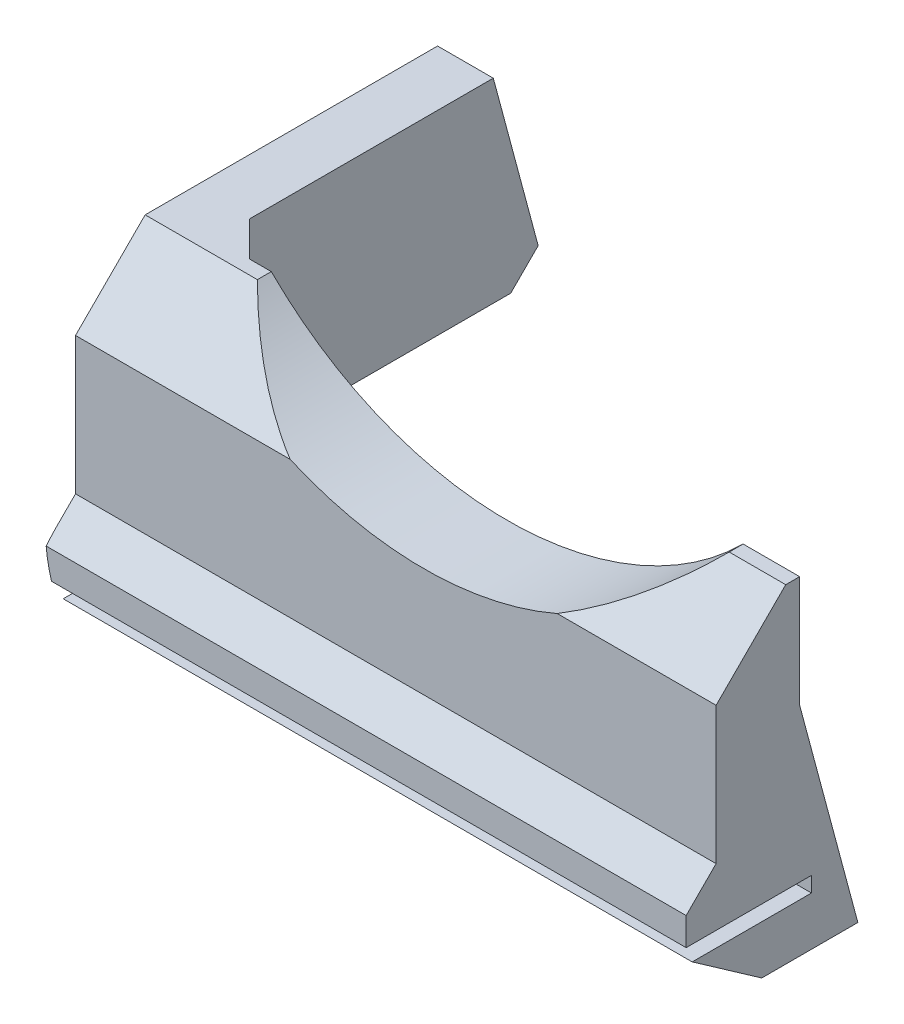
ISO-10303-21;
HEADER;
FILE_DESCRIPTION(('STEP AP214'),'2;1');
FILE_NAME('part.step','',(''),(''),'','','');
FILE_SCHEMA(('AUTOMOTIVE_DESIGN { 1 0 10303 214 1 1 1 1 }'));
ENDSEC;
DATA;
#1=APPLICATION_CONTEXT('core data for automotive mechanical design processes');
#2=APPLICATION_PROTOCOL_DEFINITION('international standard','automotive_design',2000,#1);
#3=PRODUCT_CONTEXT('',#1,'mechanical');
#4=PRODUCT('Part','Part','',(#3));
#5=PRODUCT_RELATED_PRODUCT_CATEGORY('part','',(#4));
#6=PRODUCT_DEFINITION_FORMATION('','',#4);
#7=PRODUCT_DEFINITION_CONTEXT('part definition',#1,'design');
#8=PRODUCT_DEFINITION('design','',#6,#7);
#9=PRODUCT_DEFINITION_SHAPE('','',#8);
#10=(LENGTH_UNIT() NAMED_UNIT(*) SI_UNIT(.MILLI.,.METRE.));
#11=(NAMED_UNIT(*) PLANE_ANGLE_UNIT() SI_UNIT($,.RADIAN.));
#12=(NAMED_UNIT(*) SI_UNIT($,.STERADIAN.) SOLID_ANGLE_UNIT());
#13=UNCERTAINTY_MEASURE_WITH_UNIT(LENGTH_MEASURE(1.E-05),#10,'distance_accuracy_value','');
#14=(GEOMETRIC_REPRESENTATION_CONTEXT(3) GLOBAL_UNCERTAINTY_ASSIGNED_CONTEXT((#13)) GLOBAL_UNIT_ASSIGNED_CONTEXT((#10,
#11,#12)) REPRESENTATION_CONTEXT('',''));
#15=CARTESIAN_POINT('',(0.,0.,0.));
#16=DIRECTION('',(0.,0.,1.));
#17=DIRECTION('',(1.,0.,0.));
#18=AXIS2_PLACEMENT_3D('',#15,#16,#17);
#19=CARTESIAN_POINT('',(21.,-6.,-4.));
#20=DIRECTION('',(0.,-0.258819045102525,0.965925826289067));
#21=DIRECTION('',(0.,-0.965925826289067,-0.258819045102525));
#22=AXIS2_PLACEMENT_3D('',#19,#20,#21);
#23=PLANE('',#22);
#24=DIRECTION('',(1.,0.,0.));
#25=VECTOR('',#24,1.);
#26=CARTESIAN_POINT('',(21.,3.42457351945711,-1.47469313645368));
#27=LINE('',#26,#25);
#28=CARTESIAN_POINT('',(-24.9834304908428,3.42457351945711,-1.47469313645368));
#29=VERTEX_POINT('',#28);
#30=CARTESIAN_POINT('',(-20.8245735194571,3.42457351945711,-1.47469313645368));
#31=VERTEX_POINT('',#30);
#32=EDGE_CURVE('E232',#29,#31,#27,.T.);
#33=ORIENTED_EDGE('',*,*,#32,.T.);
#34=DIRECTION('',(-0.250562807085739,-0.935113126531026,-0.250562807085735));
#35=VECTOR('',#34,1.);
#36=CARTESIAN_POINT('',(-12.6423857518416,33.9609139852658,6.70749463116171));
#37=LINE('',#36,#35);
#38=CARTESIAN_POINT('',(-18.5,12.1,0.849880383003405));
#39=VERTEX_POINT('',#38);
#40=EDGE_CURVE('E361',#31,#39,#37,.F.);
#41=ORIENTED_EDGE('',*,*,#40,.T.);
#42=DIRECTION('',(-1.,0.,0.));
#43=VECTOR('',#42,1.);
#44=CARTESIAN_POINT('',(21.,12.1,0.849880383003405));
#45=LINE('',#44,#43);
#46=CARTESIAN_POINT('',(21.,12.1,0.849880383003405));
#47=VERTEX_POINT('',#46);
#48=EDGE_CURVE('E306',#47,#39,#45,.T.);
#49=ORIENTED_EDGE('',*,*,#48,.F.);
#50=DIRECTION('',(0.,0.965925826289067,0.258819045102525));
#51=VECTOR('',#50,1.);
#52=CARTESIAN_POINT('',(21.,-6.,-4.));
#53=LINE('',#52,#51);
#54=CARTESIAN_POINT('',(21.,-3.5,-3.33012701892218));
#55=VERTEX_POINT('',#54);
#56=EDGE_CURVE('E263',#55,#47,#53,.T.);
#57=ORIENTED_EDGE('',*,*,#56,.F.);
#58=DIRECTION('',(0.694746590606867,0.694746590606863,0.186156787897388));
#59=VECTOR('',#58,1.);
#60=CARTESIAN_POINT('',(21.4306913006395,-3.06930869936054,-3.21472363272873));
#61=LINE('',#60,#59);
#62=CARTESIAN_POINT('',(18.5,-6.,-4.));
#63=VERTEX_POINT('',#62);
#64=EDGE_CURVE('E359',#55,#63,#61,.F.);
#65=ORIENTED_EDGE('',*,*,#64,.T.);
#66=DIRECTION('',(-1.,0.,0.));
#67=VECTOR('',#66,1.);
#68=CARTESIAN_POINT('',(21.,-6.,-4.));
#69=LINE('',#68,#67);
#70=CARTESIAN_POINT('',(-15.,-6.,-4.));
#71=VERTEX_POINT('',#70);
#72=EDGE_CURVE('E284',#63,#71,#69,.T.);
#73=ORIENTED_EDGE('',*,*,#72,.T.);
#74=CARTESIAN_POINT('',(-15.,4.,-1.32050807568873));
#75=DIRECTION('',(0.,-0.258819045102525,0.965925826289067));
#76=DIRECTION('',(0.,-0.965925826289067,-0.258819045102525));
#77=AXIS2_PLACEMENT_3D('',#74,#75,#76);
#78=ELLIPSE('',#77,10.3527618041008,10.);
#79=EDGE_CURVE('E343',#71,#29,#78,.F.);
#80=ORIENTED_EDGE('',*,*,#79,.T.);
#81=EDGE_LOOP('',(#33,#41,#49,#57,#65,#73,#80));
#82=FACE_BOUND('',#81,.T.);
#83=ADVANCED_FACE('F36',(#82),#23,.F.);
#84=CARTESIAN_POINT('',(21.,5.25011961699659,6.8498803830034));
#85=DIRECTION('',(0.,0.,-1.));
#86=DIRECTION('',(-1.,0.,0.));
#87=AXIS2_PLACEMENT_3D('',#84,#85,#86);
#88=PLANE('',#87);
#89=CARTESIAN_POINT('',(0.,37.1,6.8498803830034));
#90=DIRECTION('',(0.,0.,-1.));
#91=DIRECTION('',(-1.,0.,0.));
#92=AXIS2_PLACEMENT_3D('',#89,#90,#91);
#93=CIRCLE('',#92,24.);
#94=CARTESIAN_POINT('',(9.59166304662542,15.1,6.84988038300341));
#95=VERTEX_POINT('',#94);
#96=CARTESIAN_POINT('',(-9.59166304662542,15.1,6.84988038300341));
#97=VERTEX_POINT('',#96);
#98=EDGE_CURVE('E245',#95,#97,#93,.T.);
#99=ORIENTED_EDGE('',*,*,#98,.T.);
#100=DIRECTION('',(-1.,0.,0.));
#101=VECTOR('',#100,1.);
#102=CARTESIAN_POINT('',(-21.,15.1,6.8498803830034));
#103=LINE('',#102,#101);
#104=CARTESIAN_POINT('',(-25.,15.1,6.84988038300341));
#105=VERTEX_POINT('',#104);
#106=EDGE_CURVE('E312',#97,#105,#103,.T.);
#107=ORIENTED_EDGE('',*,*,#106,.T.);
#108=DIRECTION('',(0.,1.,0.));
#109=VECTOR('',#108,1.);
#110=CARTESIAN_POINT('',(-25.,5.25011961699659,6.8498803830034));
#111=LINE('',#110,#109);
#112=CARTESIAN_POINT('',(-25.,5.25011961699659,6.8498803830034));
#113=VERTEX_POINT('',#112);
#114=EDGE_CURVE('E237',#113,#105,#111,.T.);
#115=ORIENTED_EDGE('',*,*,#114,.F.);
#116=DIRECTION('',(-1.,0.,0.));
#117=VECTOR('',#116,1.);
#118=CARTESIAN_POINT('',(21.,5.25011961699659,6.8498803830034));
#119=LINE('',#118,#117);
#120=CARTESIAN_POINT('',(21.,5.25011961699659,6.8498803830034));
#121=VERTEX_POINT('',#120);
#122=EDGE_CURVE('E303',#121,#113,#119,.T.);
#123=ORIENTED_EDGE('',*,*,#122,.F.);
#124=DIRECTION('',(0.,-1.,0.));
#125=VECTOR('',#124,1.);
#126=CARTESIAN_POINT('',(21.,5.25011961699659,6.8498803830034));
#127=LINE('',#126,#125);
#128=CARTESIAN_POINT('',(21.,15.1,6.84988038300341));
#129=VERTEX_POINT('',#128);
#130=EDGE_CURVE('E270',#129,#121,#127,.T.);
#131=ORIENTED_EDGE('',*,*,#130,.F.);
#132=DIRECTION('',(-1.,0.,0.));
#133=VECTOR('',#132,1.);
#134=CARTESIAN_POINT('',(16.9410743460974,15.1,6.8498803830034));
#135=LINE('',#134,#133);
#136=EDGE_CURVE('E309',#129,#95,#135,.T.);
#137=ORIENTED_EDGE('',*,*,#136,.T.);
#138=EDGE_LOOP('',(#99,#107,#115,#123,#131,#137));
#139=FACE_BOUND('',#138,.T.);
#140=ADVANCED_FACE('F390',(#139),#88,.F.);
#141=CARTESIAN_POINT('',(21.,3.1,9.));
#142=DIRECTION('',(0.,-0.707106781186549,-0.707106781186546));
#143=DIRECTION('',(0.,0.707106781186546,-0.707106781186549));
#144=AXIS2_PLACEMENT_3D('',#141,#142,#143);
#145=PLANE('',#144);
#146=DIRECTION('',(0.,0.707106781186546,-0.707106781186549));
#147=VECTOR('',#146,1.);
#148=CARTESIAN_POINT('',(-25.,3.1,9.));
#149=LINE('',#148,#147);
#150=CARTESIAN_POINT('',(-25.,4.,8.1));
#151=VERTEX_POINT('',#150);
#152=EDGE_CURVE('E235',#151,#113,#149,.T.);
#153=ORIENTED_EDGE('',*,*,#152,.F.);
#154=CARTESIAN_POINT('',(-15.,4.,8.1));
#155=DIRECTION('',(0.,-0.707106781186549,-0.707106781186546));
#156=DIRECTION('',(0.,0.707106781186546,-0.707106781186549));
#157=AXIS2_PLACEMENT_3D('',#154,#155,#156);
#158=ELLIPSE('',#157,14.142135623731,10.);
#159=CARTESIAN_POINT('',(-24.9594176536583,3.1,9.));
#160=VERTEX_POINT('',#159);
#161=EDGE_CURVE('E327',#151,#160,#158,.F.);
#162=ORIENTED_EDGE('',*,*,#161,.T.);
#163=DIRECTION('',(-1.,0.,0.));
#164=VECTOR('',#163,1.);
#165=CARTESIAN_POINT('',(21.,3.1,9.));
#166=LINE('',#165,#164);
#167=CARTESIAN_POINT('',(21.,3.1,9.));
#168=VERTEX_POINT('',#167);
#169=EDGE_CURVE('E300',#168,#160,#166,.T.);
#170=ORIENTED_EDGE('',*,*,#169,.F.);
#171=DIRECTION('',(0.,-0.707106781186546,0.707106781186549));
#172=VECTOR('',#171,1.);
#173=CARTESIAN_POINT('',(21.,3.1,9.));
#174=LINE('',#173,#172);
#175=EDGE_CURVE('E272',#121,#168,#174,.T.);
#176=ORIENTED_EDGE('',*,*,#175,.F.);
#177=ORIENTED_EDGE('',*,*,#122,.T.);
#178=EDGE_LOOP('',(#153,#162,#170,#176,#177));
#179=FACE_BOUND('',#178,.T.);
#180=ADVANCED_FACE('F406',(#179),#145,.F.);
#181=CARTESIAN_POINT('',(21.,1.1,9.));
#182=DIRECTION('',(0.,0.,-1.));
#183=DIRECTION('',(-1.,0.,0.));
#184=AXIS2_PLACEMENT_3D('',#181,#182,#183);
#185=PLANE('',#184);
#186=ORIENTED_EDGE('',*,*,#169,.T.);
#187=CARTESIAN_POINT('',(-15.,4.,9.));
#188=DIRECTION('',(0.,0.,-1.));
#189=DIRECTION('',(-1.,0.,0.));
#190=AXIS2_PLACEMENT_3D('',#187,#188,#189);
#191=CIRCLE('',#190,10.);
#192=CARTESIAN_POINT('',(-24.5702664539708,1.1,9.));
#193=VERTEX_POINT('',#192);
#194=EDGE_CURVE('E329',#160,#193,#191,.F.);
#195=ORIENTED_EDGE('',*,*,#194,.T.);
#196=DIRECTION('',(-1.,0.,0.));
#197=VECTOR('',#196,1.);
#198=CARTESIAN_POINT('',(21.,1.1,9.));
#199=LINE('',#198,#197);
#200=CARTESIAN_POINT('',(21.,1.1,9.));
#201=VERTEX_POINT('',#200);
#202=EDGE_CURVE('E297',#201,#193,#199,.T.);
#203=ORIENTED_EDGE('',*,*,#202,.F.);
#204=DIRECTION('',(0.,-1.,0.));
#205=VECTOR('',#204,1.);
#206=CARTESIAN_POINT('',(21.,1.1,9.));
#207=LINE('',#206,#205);
#208=EDGE_CURVE('E274',#168,#201,#207,.T.);
#209=ORIENTED_EDGE('',*,*,#208,.F.);
#210=EDGE_LOOP('',(#186,#195,#203,#209));
#211=FACE_BOUND('',#210,.T.);
#212=ADVANCED_FACE('F413',(#211),#185,.F.);
#213=CARTESIAN_POINT('',(21.,1.1,0.));
#214=DIRECTION('',(0.,1.,0.));
#215=DIRECTION('',(0.,0.,1.));
#216=AXIS2_PLACEMENT_3D('',#213,#214,#215);
#217=PLANE('',#216);
#218=ORIENTED_EDGE('',*,*,#202,.T.);
#219=DIRECTION('',(0.,0.,-1.));
#220=VECTOR('',#219,1.);
#221=CARTESIAN_POINT('',(-24.5702664539709,1.1,9.));
#222=LINE('',#221,#220);
#223=CARTESIAN_POINT('',(-24.5702664539709,1.1,0.));
#224=VERTEX_POINT('',#223);
#225=EDGE_CURVE('E331',#193,#224,#222,.T.);
#226=ORIENTED_EDGE('',*,*,#225,.T.);
#227=DIRECTION('',(-1.,0.,0.));
#228=VECTOR('',#227,1.);
#229=CARTESIAN_POINT('',(21.,1.1,0.));
#230=LINE('',#229,#228);
#231=CARTESIAN_POINT('',(21.,1.1,0.));
#232=VERTEX_POINT('',#231);
#233=EDGE_CURVE('E294',#232,#224,#230,.T.);
#234=ORIENTED_EDGE('',*,*,#233,.F.);
#235=DIRECTION('',(0.,0.,-1.));
#236=VECTOR('',#235,1.);
#237=CARTESIAN_POINT('',(21.,1.1,0.));
#238=LINE('',#237,#236);
#239=EDGE_CURVE('E276',#201,#232,#238,.T.);
#240=ORIENTED_EDGE('',*,*,#239,.F.);
#241=EDGE_LOOP('',(#218,#226,#234,#240));
#242=FACE_BOUND('',#241,.T.);
#243=ADVANCED_FACE('F417',(#242),#217,.F.);
#244=CARTESIAN_POINT('',(21.,0.,0.));
#245=DIRECTION('',(0.,0.,-1.));
#246=DIRECTION('',(-1.,0.,0.));
#247=AXIS2_PLACEMENT_3D('',#244,#245,#246);
#248=PLANE('',#247);
#249=ORIENTED_EDGE('',*,*,#233,.T.);
#250=CARTESIAN_POINT('',(-15.,4.,0.));
#251=DIRECTION('',(0.,0.,-1.));
#252=DIRECTION('',(-1.,0.,0.));
#253=AXIS2_PLACEMENT_3D('',#250,#251,#252);
#254=CIRCLE('',#253,10.);
#255=CARTESIAN_POINT('',(-24.1651513899117,0.,0.));
#256=VERTEX_POINT('',#255);
#257=EDGE_CURVE('E333',#224,#256,#254,.F.);
#258=ORIENTED_EDGE('',*,*,#257,.T.);
#259=DIRECTION('',(-1.,0.,0.));
#260=VECTOR('',#259,1.);
#261=CARTESIAN_POINT('',(21.,0.,0.));
#262=LINE('',#261,#260);
#263=CARTESIAN_POINT('',(21.,0.,0.));
#264=VERTEX_POINT('',#263);
#265=EDGE_CURVE('E291',#264,#256,#262,.T.);
#266=ORIENTED_EDGE('',*,*,#265,.F.);
#267=DIRECTION('',(0.,-1.,0.));
#268=VECTOR('',#267,1.);
#269=CARTESIAN_POINT('',(21.,0.,0.));
#270=LINE('',#269,#268);
#271=EDGE_CURVE('E278',#232,#264,#270,.T.);
#272=ORIENTED_EDGE('',*,*,#271,.F.);
#273=EDGE_LOOP('',(#249,#258,#266,#272));
#274=FACE_BOUND('',#273,.T.);
#275=ADVANCED_FACE('F422',(#274),#248,.F.);
#276=CARTESIAN_POINT('',(21.,0.,8.56888804045279));
#277=DIRECTION('',(0.,-1.,0.));
#278=DIRECTION('',(0.,0.,-1.));
#279=AXIS2_PLACEMENT_3D('',#276,#277,#278);
#280=PLANE('',#279);
#281=ORIENTED_EDGE('',*,*,#265,.T.);
#282=DIRECTION('',(0.,0.,-1.));
#283=VECTOR('',#282,1.);
#284=CARTESIAN_POINT('',(-24.1651513899117,0.,0.));
#285=LINE('',#284,#283);
#286=CARTESIAN_POINT('',(-24.1651513899117,0.,8.56888804045279));
#287=VERTEX_POINT('',#286);
#288=EDGE_CURVE('E335',#256,#287,#285,.F.);
#289=ORIENTED_EDGE('',*,*,#288,.T.);
#290=DIRECTION('',(-1.,0.,0.));
#291=VECTOR('',#290,1.);
#292=CARTESIAN_POINT('',(21.,0.,8.56888804045279));
#293=LINE('',#292,#291);
#294=CARTESIAN_POINT('',(21.,0.,8.56888804045279));
#295=VERTEX_POINT('',#294);
#296=EDGE_CURVE('E288',#295,#287,#293,.T.);
#297=ORIENTED_EDGE('',*,*,#296,.F.);
#298=DIRECTION('',(0.,0.,1.));
#299=VECTOR('',#298,1.);
#300=CARTESIAN_POINT('',(21.,0.,8.56888804045279));
#301=LINE('',#300,#299);
#302=EDGE_CURVE('E280',#264,#295,#301,.T.);
#303=ORIENTED_EDGE('',*,*,#302,.F.);
#304=EDGE_LOOP('',(#281,#289,#297,#303));
#305=FACE_BOUND('',#304,.T.);
#306=ADVANCED_FACE('F426',(#305),#280,.F.);
#307=CARTESIAN_POINT('',(21.,-6.,0.));
#308=DIRECTION('',(0.,0.819152044288995,-0.573576436351041));
#309=DIRECTION('',(0.,0.573576436351041,0.819152044288995));
#310=AXIS2_PLACEMENT_3D('',#307,#308,#309);
#311=PLANE('',#310);
#312=DIRECTION('',(-1.,0.,0.));
#313=VECTOR('',#312,1.);
#314=CARTESIAN_POINT('',(21.,-6.,0.));
#315=LINE('',#314,#313);
#316=CARTESIAN_POINT('',(18.5,-6.,0.));
#317=VERTEX_POINT('',#316);
#318=CARTESIAN_POINT('',(-15.,-6.,0.));
#319=VERTEX_POINT('',#318);
#320=EDGE_CURVE('E286',#317,#319,#315,.T.);
#321=ORIENTED_EDGE('',*,*,#320,.F.);
#322=DIRECTION('',(-0.497542812164522,-0.497542812164519,-0.710564775461633));
#323=VECTOR('',#322,1.);
#324=CARTESIAN_POINT('',(19.7377442496829,-4.7622557503171,1.76768198304117));
#325=LINE('',#324,#323);
#326=CARTESIAN_POINT('',(21.,-3.5,3.57037001685533));
#327=VERTEX_POINT('',#326);
#328=EDGE_CURVE('E58',#317,#327,#325,.F.);
#329=ORIENTED_EDGE('',*,*,#328,.T.);
#330=DIRECTION('',(0.,-0.573576436351041,-0.819152044288995));
#331=VECTOR('',#330,1.);
#332=CARTESIAN_POINT('',(21.,-6.,0.));
#333=LINE('',#332,#331);
#334=EDGE_CURVE('E282',#295,#327,#333,.T.);
#335=ORIENTED_EDGE('',*,*,#334,.F.);
#336=ORIENTED_EDGE('',*,*,#296,.T.);
#337=CARTESIAN_POINT('',(-15.,4.,14.2814800674213));
#338=DIRECTION('',(0.,0.819152044288995,-0.573576436351041));
#339=DIRECTION('',(0.,-0.573576436351041,-0.819152044288995));
#340=AXIS2_PLACEMENT_3D('',#337,#338,#339);
#341=ELLIPSE('',#340,17.4344679562111,10.);
#342=EDGE_CURVE('E337',#287,#319,#341,.F.);
#343=ORIENTED_EDGE('',*,*,#342,.T.);
#344=EDGE_LOOP('',(#321,#329,#335,#336,#343));
#345=FACE_BOUND('',#344,.T.);
#346=ADVANCED_FACE('F429',(#345),#311,.F.);
#347=CARTESIAN_POINT('',(21.,-6.,0.));
#348=DIRECTION('',(0.,1.,0.));
#349=DIRECTION('',(0.,0.,1.));
#350=AXIS2_PLACEMENT_3D('',#347,#348,#349);
#351=PLANE('',#350);
#352=ORIENTED_EDGE('',*,*,#72,.F.);
#353=DIRECTION('',(0.,0.,1.));
#354=VECTOR('',#353,1.);
#355=CARTESIAN_POINT('',(18.5,-6.,0.));
#356=LINE('',#355,#354);
#357=EDGE_CURVE('E51',#63,#317,#356,.T.);
#358=ORIENTED_EDGE('',*,*,#357,.T.);
#359=ORIENTED_EDGE('',*,*,#320,.T.);
#360=DIRECTION('',(0.,0.,1.));
#361=VECTOR('',#360,1.);
#362=CARTESIAN_POINT('',(-15.,-6.,-4.));
#363=LINE('',#362,#361);
#364=EDGE_CURVE('E340',#319,#71,#363,.F.);
#365=ORIENTED_EDGE('',*,*,#364,.T.);
#366=EDGE_LOOP('',(#352,#358,#359,#365));
#367=FACE_BOUND('',#366,.T.);
#368=ADVANCED_FACE('F431',(#367),#351,.F.);
#369=CARTESIAN_POINT('',(21.,0.,0.));
#370=DIRECTION('',(-1.,0.,0.));
#371=DIRECTION('',(0.,0.,1.));
#372=AXIS2_PLACEMENT_3D('',#369,#370,#371);
#373=PLANE('',#372);
#374=ORIENTED_EDGE('',*,*,#334,.T.);
#375=DIRECTION('',(0.,0.,-1.));
#376=VECTOR('',#375,1.);
#377=CARTESIAN_POINT('',(21.,-3.5,0.));
#378=LINE('',#377,#376);
#379=EDGE_CURVE('E363',#327,#55,#378,.T.);
#380=ORIENTED_EDGE('',*,*,#379,.T.);
#381=ORIENTED_EDGE('',*,*,#56,.T.);
#382=DIRECTION('',(0.,1.,0.));
#383=VECTOR('',#382,1.);
#384=CARTESIAN_POINT('',(21.,12.1,0.849880383003405));
#385=LINE('',#384,#383);
#386=CARTESIAN_POINT('',(21.,20.1,0.849880383003405));
#387=VERTEX_POINT('',#386);
#388=EDGE_CURVE('E248',#47,#387,#385,.T.);
#389=ORIENTED_EDGE('',*,*,#388,.T.);
#390=DIRECTION('',(0.,0.,1.));
#391=VECTOR('',#390,1.);
#392=CARTESIAN_POINT('',(21.,20.1,0.849880383003405));
#393=LINE('',#392,#391);
#394=CARTESIAN_POINT('',(21.,20.1,1.84988038300339));
#395=VERTEX_POINT('',#394);
#396=EDGE_CURVE('E257',#387,#395,#393,.T.);
#397=ORIENTED_EDGE('',*,*,#396,.T.);
#398=DIRECTION('',(0.,-0.707106781186547,0.707106781186548));
#399=VECTOR('',#398,1.);
#400=CARTESIAN_POINT('',(21.,15.1,6.8498803830034));
#401=LINE('',#400,#399);
#402=EDGE_CURVE('E322',#395,#129,#401,.T.);
#403=ORIENTED_EDGE('',*,*,#402,.T.);
#404=ORIENTED_EDGE('',*,*,#130,.T.);
#405=ORIENTED_EDGE('',*,*,#175,.T.);
#406=ORIENTED_EDGE('',*,*,#208,.T.);
#407=ORIENTED_EDGE('',*,*,#239,.T.);
#408=ORIENTED_EDGE('',*,*,#271,.T.);
#409=ORIENTED_EDGE('',*,*,#302,.T.);
#410=EDGE_LOOP('',(#374,#380,#381,#389,#397,#403,#404,#405,#406,#407,#408,#409));
#411=FACE_BOUND('',#410,.T.);
#412=ADVANCED_FACE('F370',(#411),#373,.F.);
#413=CARTESIAN_POINT('',(-21.,20.1,0.849880383003405));
#414=DIRECTION('',(0.,1.,0.));
#415=DIRECTION('',(0.,0.,1.));
#416=AXIS2_PLACEMENT_3D('',#413,#414,#415);
#417=PLANE('',#416);
#418=DIRECTION('',(-1.,0.,0.));
#419=VECTOR('',#418,1.);
#420=CARTESIAN_POINT('',(-21.,20.1,0.849880383003405));
#421=LINE('',#420,#419);
#422=CARTESIAN_POINT('',(-16.9410743460974,20.1,0.849880383003405));
#423=VERTEX_POINT('',#422);
#424=CARTESIAN_POINT('',(-18.5,20.1,0.849880383003405));
#425=VERTEX_POINT('',#424);
#426=EDGE_CURVE('E246',#423,#425,#421,.T.);
#427=ORIENTED_EDGE('',*,*,#426,.T.);
#428=DIRECTION('',(0.707106781186552,0.,0.707106781186543));
#429=VECTOR('',#428,1.);
#430=CARTESIAN_POINT('',(-18.5,20.1,0.849880383003405));
#431=LINE('',#430,#429);
#432=CARTESIAN_POINT('',(-21.,20.1,-1.65011961699659));
#433=VERTEX_POINT('',#432);
#434=EDGE_CURVE('E44',#425,#433,#431,.F.);
#435=ORIENTED_EDGE('',*,*,#434,.T.);
#436=DIRECTION('',(0.,0.,-1.));
#437=VECTOR('',#436,1.);
#438=CARTESIAN_POINT('',(-21.,20.1,0.849880383003405));
#439=LINE('',#438,#437);
#440=CARTESIAN_POINT('',(-21.,20.1,-19.1501196169966));
#441=VERTEX_POINT('',#440);
#442=EDGE_CURVE('E193',#433,#441,#439,.T.);
#443=ORIENTED_EDGE('',*,*,#442,.T.);
#444=DIRECTION('',(-1.,0.,0.));
#445=VECTOR('',#444,1.);
#446=CARTESIAN_POINT('',(-21.,20.1,-19.1501196169966));
#447=LINE('',#446,#445);
#448=CARTESIAN_POINT('',(-25.,20.1,-19.1501196169966));
#449=VERTEX_POINT('',#448);
#450=EDGE_CURVE('E198',#441,#449,#447,.T.);
#451=ORIENTED_EDGE('',*,*,#450,.T.);
#452=DIRECTION('',(0.,0.,-1.));
#453=VECTOR('',#452,1.);
#454=CARTESIAN_POINT('',(-25.,20.1,1.84988038300339));
#455=LINE('',#454,#453);
#456=CARTESIAN_POINT('',(-25.,20.1,1.84988038300339));
#457=VERTEX_POINT('',#456);
#458=EDGE_CURVE('E243',#457,#449,#455,.T.);
#459=ORIENTED_EDGE('',*,*,#458,.F.);
#460=DIRECTION('',(1.,0.,0.));
#461=VECTOR('',#460,1.);
#462=CARTESIAN_POINT('',(-16.9410743460974,20.1,1.84988038300339));
#463=LINE('',#462,#461);
#464=CARTESIAN_POINT('',(-16.9410743460974,20.1,1.84988038300339));
#465=VERTEX_POINT('',#464);
#466=EDGE_CURVE('E314',#457,#465,#463,.T.);
#467=ORIENTED_EDGE('',*,*,#466,.T.);
#468=DIRECTION('',(0.,0.,1.));
#469=VECTOR('',#468,1.);
#470=CARTESIAN_POINT('',(-16.9410743460974,20.1,0.849880383003405));
#471=LINE('',#470,#469);
#472=EDGE_CURVE('E260',#423,#465,#471,.T.);
#473=ORIENTED_EDGE('',*,*,#472,.F.);
#474=EDGE_LOOP('',(#427,#435,#443,#451,#459,#467,#473));
#475=FACE_BOUND('',#474,.T.);
#476=ADVANCED_FACE('F196',(#475),#417,.T.);
#477=CARTESIAN_POINT('',(0.,37.1,0.849880383003405));
#478=DIRECTION('',(0.,0.,1.));
#479=DIRECTION('',(1.,0.,0.));
#480=AXIS2_PLACEMENT_3D('',#477,#478,#479);
#481=CYLINDRICAL_SURFACE('',#480,24.);
#482=ORIENTED_EDGE('',*,*,#472,.T.);
#483=CARTESIAN_POINT('',(0.,37.1,-15.1501196169967));
#484=DIRECTION('',(0.,0.707106781186548,0.707106781186547));
#485=DIRECTION('',(0.,-0.707106781186547,0.707106781186548));
#486=AXIS2_PLACEMENT_3D('',#483,#484,#485);
#487=ELLIPSE('',#486,33.9411254969543,24.);
#488=EDGE_CURVE('E318',#465,#97,#487,.T.);
#489=ORIENTED_EDGE('',*,*,#488,.T.);
#490=ORIENTED_EDGE('',*,*,#98,.F.);
#491=CARTESIAN_POINT('',(0.,37.1,-15.1501196169967));
#492=DIRECTION('',(0.,0.707106781186548,0.707106781186547));
#493=DIRECTION('',(0.,-0.707106781186547,0.707106781186548));
#494=AXIS2_PLACEMENT_3D('',#491,#492,#493);
#495=ELLIPSE('',#494,33.9411254969543,24.);
#496=CARTESIAN_POINT('',(16.9410743460974,20.1,1.84988038300339));
#497=VERTEX_POINT('',#496);
#498=EDGE_CURVE('E316',#95,#497,#495,.T.);
#499=ORIENTED_EDGE('',*,*,#498,.T.);
#500=DIRECTION('',(0.,0.,1.));
#501=VECTOR('',#500,1.);
#502=CARTESIAN_POINT('',(16.9410743460974,20.1,0.849880383003405));
#503=LINE('',#502,#501);
#504=CARTESIAN_POINT('',(16.9410743460974,20.1,0.849880383003405));
#505=VERTEX_POINT('',#504);
#506=EDGE_CURVE('E264',#505,#497,#503,.T.);
#507=ORIENTED_EDGE('',*,*,#506,.F.);
#508=CARTESIAN_POINT('',(0.,37.1,0.849880383003405));
#509=DIRECTION('',(0.,0.,-1.));
#510=DIRECTION('',(-1.,0.,0.));
#511=AXIS2_PLACEMENT_3D('',#508,#509,#510);
#512=CIRCLE('',#511,24.);
#513=EDGE_CURVE('E254',#505,#423,#512,.T.);
#514=ORIENTED_EDGE('',*,*,#513,.T.);
#515=EDGE_LOOP('',(#482,#489,#490,#499,#507,#514));
#516=FACE_BOUND('',#515,.T.);
#517=ADVANCED_FACE('F394',(#516),#481,.F.);
#518=CARTESIAN_POINT('',(21.,20.1,0.849880383003405));
#519=DIRECTION('',(0.,1.,0.));
#520=DIRECTION('',(0.,0.,1.));
#521=AXIS2_PLACEMENT_3D('',#518,#519,#520);
#522=PLANE('',#521);
#523=ORIENTED_EDGE('',*,*,#506,.T.);
#524=DIRECTION('',(1.,0.,0.));
#525=VECTOR('',#524,1.);
#526=CARTESIAN_POINT('',(21.,20.1,1.84988038300339));
#527=LINE('',#526,#525);
#528=EDGE_CURVE('E320',#497,#395,#527,.T.);
#529=ORIENTED_EDGE('',*,*,#528,.T.);
#530=ORIENTED_EDGE('',*,*,#396,.F.);
#531=DIRECTION('',(-1.,0.,0.));
#532=VECTOR('',#531,1.);
#533=CARTESIAN_POINT('',(21.,20.1,0.849880383003405));
#534=LINE('',#533,#532);
#535=EDGE_CURVE('E251',#387,#505,#534,.T.);
#536=ORIENTED_EDGE('',*,*,#535,.T.);
#537=EDGE_LOOP('',(#523,#529,#530,#536));
#538=FACE_BOUND('',#537,.T.);
#539=ADVANCED_FACE('F476',(#538),#522,.T.);
#540=CARTESIAN_POINT('',(0.,37.1,0.849880383003405));
#541=DIRECTION('',(0.,0.,-1.));
#542=DIRECTION('',(-1.,0.,0.));
#543=AXIS2_PLACEMENT_3D('',#540,#541,#542);
#544=PLANE('',#543);
#545=ORIENTED_EDGE('',*,*,#48,.T.);
#546=DIRECTION('',(0.,1.,0.));
#547=VECTOR('',#546,1.);
#548=CARTESIAN_POINT('',(-18.5,20.1,0.849880383003405));
#549=LINE('',#548,#547);
#550=EDGE_CURVE('E356',#39,#425,#549,.T.);
#551=ORIENTED_EDGE('',*,*,#550,.T.);
#552=ORIENTED_EDGE('',*,*,#426,.F.);
#553=ORIENTED_EDGE('',*,*,#513,.F.);
#554=ORIENTED_EDGE('',*,*,#535,.F.);
#555=ORIENTED_EDGE('',*,*,#388,.F.);
#556=EDGE_LOOP('',(#545,#551,#552,#553,#554,#555));
#557=FACE_BOUND('',#556,.T.);
#558=ADVANCED_FACE('F379',(#557),#544,.T.);
#559=CARTESIAN_POINT('',(21.,15.1,6.8498803830034));
#560=DIRECTION('',(0.,0.707106781186548,0.707106781186547));
#561=DIRECTION('',(1.,0.,0.));
#562=AXIS2_PLACEMENT_3D('',#559,#560,#561);
#563=PLANE('',#562);
#564=ORIENTED_EDGE('',*,*,#488,.F.);
#565=ORIENTED_EDGE('',*,*,#466,.F.);
#566=DIRECTION('',(0.,0.707106781186547,-0.707106781186548));
#567=VECTOR('',#566,1.);
#568=CARTESIAN_POINT('',(-25.,15.1,6.84988038300341));
#569=LINE('',#568,#567);
#570=EDGE_CURVE('E240',#105,#457,#569,.T.);
#571=ORIENTED_EDGE('',*,*,#570,.F.);
#572=ORIENTED_EDGE('',*,*,#106,.F.);
#573=EDGE_LOOP('',(#564,#565,#571,#572));
#574=FACE_BOUND('',#573,.T.);
#575=ADVANCED_FACE('F397',(#574),#563,.T.);
#576=CARTESIAN_POINT('',(21.,15.1,6.8498803830034));
#577=DIRECTION('',(0.,0.707106781186548,0.707106781186547));
#578=DIRECTION('',(1.,0.,0.));
#579=AXIS2_PLACEMENT_3D('',#576,#577,#578);
#580=PLANE('',#579);
#581=ORIENTED_EDGE('',*,*,#402,.F.);
#582=ORIENTED_EDGE('',*,*,#528,.F.);
#583=ORIENTED_EDGE('',*,*,#498,.F.);
#584=ORIENTED_EDGE('',*,*,#136,.F.);
#585=EDGE_LOOP('',(#581,#582,#583,#584));
#586=FACE_BOUND('',#585,.T.);
#587=ADVANCED_FACE('F387',(#586),#580,.T.);
#588=CARTESIAN_POINT('',(-25.,0.,0.));
#589=DIRECTION('',(-1.,0.,0.));
#590=DIRECTION('',(0.,0.,1.));
#591=AXIS2_PLACEMENT_3D('',#588,#589,#590);
#592=PLANE('',#591);
#593=DIRECTION('',(0.,-0.965925826289067,-0.258819045102525));
#594=VECTOR('',#593,1.);
#595=CARTESIAN_POINT('',(-25.,20.1,-19.1501196169966));
#596=LINE('',#595,#594);
#597=CARTESIAN_POINT('',(-25.,8.07168783648703,-22.3730961475194));
#598=VERTEX_POINT('',#597);
#599=EDGE_CURVE('E212',#449,#598,#596,.T.);
#600=ORIENTED_EDGE('',*,*,#599,.T.);
#601=DIRECTION('',(0.,0.707106781186546,-0.707106781186549));
#602=VECTOR('',#601,1.);
#603=CARTESIAN_POINT('',(-25.,-7.15070415551617,-7.15070415551615));
#604=LINE('',#603,#602);
#605=CARTESIAN_POINT('',(-25.,6.1,-20.4014083110324));
#606=VERTEX_POINT('',#605);
#607=EDGE_CURVE('E349',#598,#606,#604,.F.);
#608=ORIENTED_EDGE('',*,*,#607,.T.);
#609=DIRECTION('',(0.,0.,1.));
#610=VECTOR('',#609,1.);
#611=CARTESIAN_POINT('',(-25.,6.1,-4.15011961699654));
#612=LINE('',#611,#610);
#613=CARTESIAN_POINT('',(-25.,6.1,-4.15011961699654));
#614=VERTEX_POINT('',#613);
#615=EDGE_CURVE('E227',#606,#614,#612,.T.);
#616=ORIENTED_EDGE('',*,*,#615,.T.);
#617=DIRECTION('',(0.,-0.707106781186551,0.707106781186544));
#618=VECTOR('',#617,1.);
#619=CARTESIAN_POINT('',(-25.,1.1,0.849880383003405));
#620=LINE('',#619,#618);
#621=CARTESIAN_POINT('',(-25.,4.,-2.05011961699656));
#622=VERTEX_POINT('',#621);
#623=EDGE_CURVE('E204',#614,#622,#620,.T.);
#624=ORIENTED_EDGE('',*,*,#623,.T.);
#625=DIRECTION('',(0.,0.,1.));
#626=VECTOR('',#625,1.);
#627=CARTESIAN_POINT('',(-25.,4.,0.));
#628=LINE('',#627,#626);
#629=EDGE_CURVE('E324',#622,#151,#628,.T.);
#630=ORIENTED_EDGE('',*,*,#629,.T.);
#631=ORIENTED_EDGE('',*,*,#152,.T.);
#632=ORIENTED_EDGE('',*,*,#114,.T.);
#633=ORIENTED_EDGE('',*,*,#570,.T.);
#634=ORIENTED_EDGE('',*,*,#458,.T.);
#635=EDGE_LOOP('',(#600,#608,#616,#624,#630,#631,#632,#633,#634));
#636=FACE_BOUND('',#635,.T.);
#637=ADVANCED_FACE('F401',(#636),#592,.T.);
#638=CARTESIAN_POINT('',(-21.,0.,0.));
#639=DIRECTION('',(1.,0.,0.));
#640=DIRECTION('',(0.,0.,-1.));
#641=AXIS2_PLACEMENT_3D('',#638,#639,#640);
#642=PLANE('',#641);
#643=DIRECTION('',(0.,0.,1.));
#644=VECTOR('',#643,1.);
#645=CARTESIAN_POINT('',(-21.,6.1,-22.9014083110324));
#646=LINE('',#645,#644);
#647=CARTESIAN_POINT('',(-21.,6.1,-20.4014083110324));
#648=VERTEX_POINT('',#647);
#649=CARTESIAN_POINT('',(-21.,6.1,-4.15011961699654));
#650=VERTEX_POINT('',#649);
#651=EDGE_CURVE('E220',#648,#650,#646,.T.);
#652=ORIENTED_EDGE('',*,*,#651,.F.);
#653=DIRECTION('',(0.,-0.707106781186546,0.707106781186549));
#654=VECTOR('',#653,1.);
#655=CARTESIAN_POINT('',(-21.,-7.15070415551617,-7.15070415551615));
#656=LINE('',#655,#654);
#657=CARTESIAN_POINT('',(-21.,8.07168783648703,-22.3730961475194));
#658=VERTEX_POINT('',#657);
#659=EDGE_CURVE('E219',#648,#658,#656,.F.);
#660=ORIENTED_EDGE('',*,*,#659,.T.);
#661=DIRECTION('',(0.,-0.965925826289067,-0.258819045102525));
#662=VECTOR('',#661,1.);
#663=CARTESIAN_POINT('',(-21.,20.1,-19.1501196169966));
#664=LINE('',#663,#662);
#665=EDGE_CURVE('E203',#441,#658,#664,.T.);
#666=ORIENTED_EDGE('',*,*,#665,.F.);
#667=ORIENTED_EDGE('',*,*,#442,.F.);
#668=DIRECTION('',(0.,-1.,0.));
#669=VECTOR('',#668,1.);
#670=CARTESIAN_POINT('',(-21.,12.1,-1.65011961699659));
#671=LINE('',#670,#669);
#672=CARTESIAN_POINT('',(-21.,3.60000000000002,-1.65011961699659));
#673=VERTEX_POINT('',#672);
#674=EDGE_CURVE('E353',#433,#673,#671,.T.);
#675=ORIENTED_EDGE('',*,*,#674,.T.);
#676=DIRECTION('',(0.,-0.707106781186551,0.707106781186544));
#677=VECTOR('',#676,1.);
#678=CARTESIAN_POINT('',(-21.,1.1,0.849880383003405));
#679=LINE('',#678,#677);
#680=EDGE_CURVE('E214',#650,#673,#679,.T.);
#681=ORIENTED_EDGE('',*,*,#680,.F.);
#682=EDGE_LOOP('',(#652,#660,#666,#667,#675,#681));
#683=FACE_BOUND('',#682,.T.);
#684=ADVANCED_FACE('F217',(#683),#642,.T.);
#685=CARTESIAN_POINT('',(-21.,1.1,0.849880383003405));
#686=DIRECTION('',(0.,-0.707106781186544,-0.707106781186551));
#687=DIRECTION('',(0.,0.707106781186551,-0.707106781186544));
#688=AXIS2_PLACEMENT_3D('',#685,#686,#687);
#689=PLANE('',#688);
#690=ORIENTED_EDGE('',*,*,#32,.F.);
#691=CARTESIAN_POINT('',(-15.,4.,-2.05011961699656));
#692=DIRECTION('',(0.,-0.707106781186544,-0.707106781186551));
#693=DIRECTION('',(0.,0.707106781186551,-0.707106781186544));
#694=AXIS2_PLACEMENT_3D('',#691,#692,#693);
#695=ELLIPSE('',#694,14.1421356237309,10.);
#696=EDGE_CURVE('E345',#29,#622,#695,.T.);
#697=ORIENTED_EDGE('',*,*,#696,.T.);
#698=ORIENTED_EDGE('',*,*,#623,.F.);
#699=DIRECTION('',(-1.,0.,0.));
#700=VECTOR('',#699,1.);
#701=CARTESIAN_POINT('',(-21.,6.1,-4.15011961699654));
#702=LINE('',#701,#700);
#703=EDGE_CURVE('E213',#650,#614,#702,.T.);
#704=ORIENTED_EDGE('',*,*,#703,.F.);
#705=ORIENTED_EDGE('',*,*,#680,.T.);
#706=DIRECTION('',(-0.577350269189629,0.577350269189627,-0.577350269189621));
#707=VECTOR('',#706,1.);
#708=CARTESIAN_POINT('',(-30.5000000000001,13.1000000000001,-11.1501196169965));
#709=LINE('',#708,#707);
#710=EDGE_CURVE('E12',#673,#31,#709,.F.);
#711=ORIENTED_EDGE('',*,*,#710,.T.);
#712=EDGE_LOOP('',(#690,#697,#698,#704,#705,#711));
#713=FACE_BOUND('',#712,.T.);
#714=ADVANCED_FACE('F467',(#713),#689,.T.);
#715=CARTESIAN_POINT('',(-21.,6.1,-4.15011961699654));
#716=DIRECTION('',(0.,-1.,0.));
#717=DIRECTION('',(0.,0.,-1.));
#718=AXIS2_PLACEMENT_3D('',#715,#716,#717);
#719=PLANE('',#718);
#720=ORIENTED_EDGE('',*,*,#615,.F.);
#721=DIRECTION('',(1.,0.,0.));
#722=VECTOR('',#721,1.);
#723=CARTESIAN_POINT('',(-21.,6.1,-20.4014083110324));
#724=LINE('',#723,#722);
#725=EDGE_CURVE('E351',#606,#648,#724,.T.);
#726=ORIENTED_EDGE('',*,*,#725,.T.);
#727=ORIENTED_EDGE('',*,*,#651,.T.);
#728=ORIENTED_EDGE('',*,*,#703,.T.);
#729=EDGE_LOOP('',(#720,#726,#727,#728));
#730=FACE_BOUND('',#729,.T.);
#731=ADVANCED_FACE('F637',(#730),#719,.T.);
#732=CARTESIAN_POINT('',(-21.,20.1,-19.1501196169966));
#733=DIRECTION('',(0.,0.258819045102525,-0.965925826289067));
#734=DIRECTION('',(0.,0.965925826289067,0.258819045102525));
#735=AXIS2_PLACEMENT_3D('',#732,#733,#734);
#736=PLANE('',#735);
#737=ORIENTED_EDGE('',*,*,#665,.T.);
#738=DIRECTION('',(-1.,0.,0.));
#739=VECTOR('',#738,1.);
#740=CARTESIAN_POINT('',(-21.,8.07168783648702,-22.3730961475194));
#741=LINE('',#740,#739);
#742=EDGE_CURVE('E347',#658,#598,#741,.T.);
#743=ORIENTED_EDGE('',*,*,#742,.T.);
#744=ORIENTED_EDGE('',*,*,#599,.F.);
#745=ORIENTED_EDGE('',*,*,#450,.F.);
#746=EDGE_LOOP('',(#737,#743,#744,#745));
#747=FACE_BOUND('',#746,.T.);
#748=ADVANCED_FACE('F208',(#747),#736,.T.);
#749=CARTESIAN_POINT('',(-15.,4.,0.));
#750=DIRECTION('',(0.,0.,-1.));
#751=DIRECTION('',(-1.,0.,0.));
#752=AXIS2_PLACEMENT_3D('',#749,#750,#751);
#753=CYLINDRICAL_SURFACE('',#752,10.);
#754=ORIENTED_EDGE('',*,*,#79,.F.);
#755=ORIENTED_EDGE('',*,*,#364,.F.);
#756=ORIENTED_EDGE('',*,*,#342,.F.);
#757=ORIENTED_EDGE('',*,*,#288,.F.);
#758=ORIENTED_EDGE('',*,*,#257,.F.);
#759=ORIENTED_EDGE('',*,*,#225,.F.);
#760=ORIENTED_EDGE('',*,*,#194,.F.);
#761=ORIENTED_EDGE('',*,*,#161,.F.);
#762=ORIENTED_EDGE('',*,*,#629,.F.);
#763=ORIENTED_EDGE('',*,*,#696,.F.);
#764=EDGE_LOOP('',(#754,#755,#756,#757,#758,#759,#760,#761,#762,#763));
#765=FACE_BOUND('',#764,.T.);
#766=ADVANCED_FACE('F451',(#765),#753,.T.);
#767=CARTESIAN_POINT('',(-21.,8.07168783648702,-22.3730961475194));
#768=DIRECTION('',(0.,0.707106781186549,0.707106781186546));
#769=DIRECTION('',(-1.,0.,0.));
#770=AXIS2_PLACEMENT_3D('',#767,#768,#769);
#771=PLANE('',#770);
#772=ORIENTED_EDGE('',*,*,#659,.F.);
#773=ORIENTED_EDGE('',*,*,#725,.F.);
#774=ORIENTED_EDGE('',*,*,#607,.F.);
#775=ORIENTED_EDGE('',*,*,#742,.F.);
#776=EDGE_LOOP('',(#772,#773,#774,#775));
#777=FACE_BOUND('',#776,.T.);
#778=ADVANCED_FACE('F454',(#777),#771,.F.);
#779=CARTESIAN_POINT('',(-18.5,37.1,0.849880383003405));
#780=DIRECTION('',(0.707106781186542,0.,-0.707106781186552));
#781=DIRECTION('',(0.,-1.,0.));
#782=AXIS2_PLACEMENT_3D('',#779,#780,#781);
#783=PLANE('',#782);
#784=ORIENTED_EDGE('',*,*,#710,.F.);
#785=ORIENTED_EDGE('',*,*,#674,.F.);
#786=ORIENTED_EDGE('',*,*,#434,.F.);
#787=ORIENTED_EDGE('',*,*,#550,.F.);
#788=ORIENTED_EDGE('',*,*,#40,.F.);
#789=EDGE_LOOP('',(#784,#785,#786,#787,#788));
#790=FACE_BOUND('',#789,.T.);
#791=ADVANCED_FACE('F457',(#790),#783,.T.);
#792=CARTESIAN_POINT('',(21.,-3.5,0.));
#793=DIRECTION('',(-0.707106781186545,0.70710678118655,0.));
#794=DIRECTION('',(0.,0.,-1.));
#795=AXIS2_PLACEMENT_3D('',#792,#793,#794);
#796=PLANE('',#795);
#797=ORIENTED_EDGE('',*,*,#328,.F.);
#798=ORIENTED_EDGE('',*,*,#357,.F.);
#799=ORIENTED_EDGE('',*,*,#64,.F.);
#800=ORIENTED_EDGE('',*,*,#379,.F.);
#801=EDGE_LOOP('',(#797,#798,#799,#800));
#802=FACE_BOUND('',#801,.T.);
#803=ADVANCED_FACE('F38',(#802),#796,.F.);
#804=CLOSED_SHELL('',(#83,#140,#180,#212,#243,#275,#306,#346,#368,#412,#476,#517,#539,#558,#575,
#587,#637,#684,#714,#731,#748,#766,#778,#791,#803));
#805=MANIFOLD_SOLID_BREP('B2',#804);
#806=ADVANCED_BREP_SHAPE_REPRESENTATION('',(#18,#805),#14);
#807=SHAPE_DEFINITION_REPRESENTATION(#9,#806);
ENDSEC;
END-ISO-10303-21;
